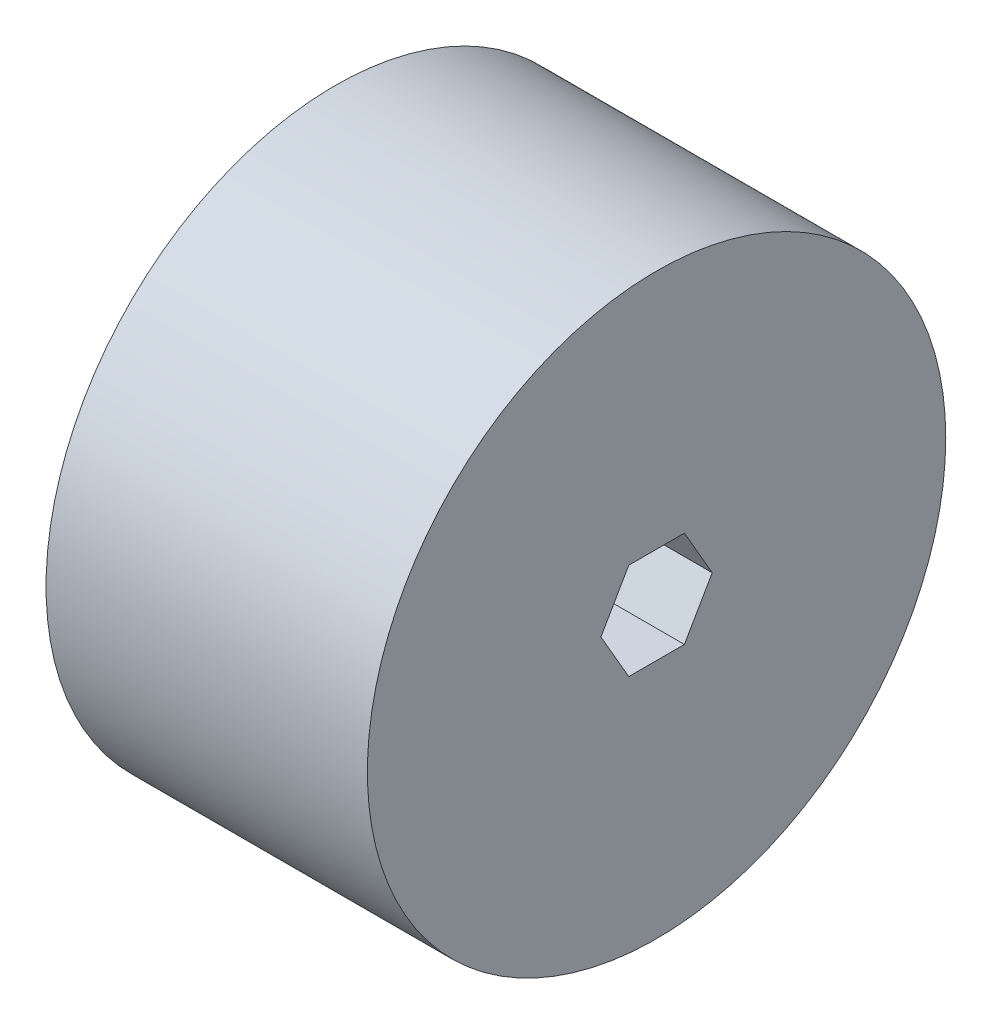
ISO-10303-21;
HEADER;
FILE_DESCRIPTION(('STEP AP214'),'2;1');
FILE_NAME('part.step','',(''),(''),'','','');
FILE_SCHEMA(('AUTOMOTIVE_DESIGN { 1 0 10303 214 1 1 1 1 }'));
ENDSEC;
DATA;
#1=APPLICATION_CONTEXT('core data for automotive mechanical design processes');
#2=APPLICATION_PROTOCOL_DEFINITION('international standard','automotive_design',2000,#1);
#3=PRODUCT_CONTEXT('',#1,'mechanical');
#4=PRODUCT('Part','Part','',(#3));
#5=PRODUCT_RELATED_PRODUCT_CATEGORY('part','',(#4));
#6=PRODUCT_DEFINITION_FORMATION('','',#4);
#7=PRODUCT_DEFINITION_CONTEXT('part definition',#1,'design');
#8=PRODUCT_DEFINITION('design','',#6,#7);
#9=PRODUCT_DEFINITION_SHAPE('','',#8);
#10=(LENGTH_UNIT() NAMED_UNIT(*) SI_UNIT(.MILLI.,.METRE.));
#11=(NAMED_UNIT(*) PLANE_ANGLE_UNIT() SI_UNIT($,.RADIAN.));
#12=(NAMED_UNIT(*) SI_UNIT($,.STERADIAN.) SOLID_ANGLE_UNIT());
#13=UNCERTAINTY_MEASURE_WITH_UNIT(LENGTH_MEASURE(1.E-05),#10,'distance_accuracy_value','');
#14=(GEOMETRIC_REPRESENTATION_CONTEXT(3) GLOBAL_UNCERTAINTY_ASSIGNED_CONTEXT((#13)) GLOBAL_UNIT_ASSIGNED_CONTEXT((#10,
#11,#12)) REPRESENTATION_CONTEXT('',''));
#15=CARTESIAN_POINT('',(0.,0.,0.));
#16=DIRECTION('',(0.,0.,1.));
#17=DIRECTION('',(1.,0.,0.));
#18=AXIS2_PLACEMENT_3D('',#15,#16,#17);
#19=CARTESIAN_POINT('',(31.75,0.,0.));
#20=DIRECTION('',(-1.,0.,0.));
#21=DIRECTION('',(0.,0.,1.));
#22=AXIS2_PLACEMENT_3D('',#19,#20,#21);
#23=CYLINDRICAL_SURFACE('',#22,28.575);
#24=CARTESIAN_POINT('',(31.75,0.,0.));
#25=DIRECTION('',(1.,0.,0.));
#26=DIRECTION('',(0.,0.,-1.));
#27=AXIS2_PLACEMENT_3D('',#24,#25,#26);
#28=CIRCLE('',#27,28.575);
#29=CARTESIAN_POINT('',(31.75,0.,-28.575));
#30=VERTEX_POINT('',#29);
#31=EDGE_CURVE('E11',#30,#30,#28,.T.);
#32=ORIENTED_EDGE('',*,*,#31,.F.);
#33=EDGE_LOOP('',(#32));
#34=FACE_BOUND('',#33,.T.);
#35=CARTESIAN_POINT('',(0.,0.,0.));
#36=DIRECTION('',(1.,0.,0.));
#37=DIRECTION('',(0.,0.,-1.));
#38=AXIS2_PLACEMENT_3D('',#35,#36,#37);
#39=CIRCLE('',#38,28.575);
#40=CARTESIAN_POINT('',(0.,0.,-28.575));
#41=VERTEX_POINT('',#40);
#42=EDGE_CURVE('E42',#41,#41,#39,.T.);
#43=ORIENTED_EDGE('',*,*,#42,.T.);
#44=EDGE_LOOP('',(#43));
#45=FACE_BOUND('',#44,.T.);
#46=ADVANCED_FACE('F39',(#34,#45),#23,.T.);
#47=CARTESIAN_POINT('',(31.75,0.,0.));
#48=DIRECTION('',(1.,0.,0.));
#49=DIRECTION('',(0.,0.,-1.));
#50=AXIS2_PLACEMENT_3D('',#47,#48,#49);
#51=PLANE('',#50);
#52=DIRECTION('',(0.,0.,1.));
#53=VECTOR('',#52,1.);
#54=CARTESIAN_POINT('',(31.75,4.7625,-2.74963065701559));
#55=LINE('',#54,#53);
#56=CARTESIAN_POINT('',(31.75,4.7625,-2.74963065701559));
#57=VERTEX_POINT('',#56);
#58=CARTESIAN_POINT('',(31.75,4.7625,2.7496306570156));
#59=VERTEX_POINT('',#58);
#60=EDGE_CURVE('E54',#57,#59,#55,.T.);
#61=ORIENTED_EDGE('',*,*,#60,.F.);
#62=DIRECTION('',(0.,0.866025403784439,0.5));
#63=VECTOR('',#62,1.);
#64=CARTESIAN_POINT('',(31.75,0.,-5.49926131403118));
#65=LINE('',#64,#63);
#66=CARTESIAN_POINT('',(31.75,0.,-5.49926131403118));
#67=VERTEX_POINT('',#66);
#68=EDGE_CURVE('E114',#67,#57,#65,.T.);
#69=ORIENTED_EDGE('',*,*,#68,.F.);
#70=DIRECTION('',(0.,0.866025403784439,-0.5));
#71=VECTOR('',#70,1.);
#72=CARTESIAN_POINT('',(31.75,-4.7625,-2.7496306570156));
#73=LINE('',#72,#71);
#74=CARTESIAN_POINT('',(31.75,-4.7625,-2.7496306570156));
#75=VERTEX_POINT('',#74);
#76=EDGE_CURVE('E118',#75,#67,#73,.T.);
#77=ORIENTED_EDGE('',*,*,#76,.F.);
#78=DIRECTION('',(0.,0.,-1.));
#79=VECTOR('',#78,1.);
#80=CARTESIAN_POINT('',(31.75,-4.7625,2.74963065701559));
#81=LINE('',#80,#79);
#82=CARTESIAN_POINT('',(31.75,-4.7625,2.74963065701559));
#83=VERTEX_POINT('',#82);
#84=EDGE_CURVE('E141',#83,#75,#81,.T.);
#85=ORIENTED_EDGE('',*,*,#84,.F.);
#86=DIRECTION('',(0.,-0.866025403784439,-0.5));
#87=VECTOR('',#86,1.);
#88=CARTESIAN_POINT('',(31.75,0.,5.49926131403118));
#89=LINE('',#88,#87);
#90=CARTESIAN_POINT('',(31.75,0.,5.49926131403118));
#91=VERTEX_POINT('',#90);
#92=EDGE_CURVE('E137',#91,#83,#89,.T.);
#93=ORIENTED_EDGE('',*,*,#92,.F.);
#94=DIRECTION('',(0.,-0.866025403784439,0.5));
#95=VECTOR('',#94,1.);
#96=CARTESIAN_POINT('',(31.75,4.7625,2.74963065701559));
#97=LINE('',#96,#95);
#98=EDGE_CURVE('E134',#59,#91,#97,.T.);
#99=ORIENTED_EDGE('',*,*,#98,.F.);
#100=EDGE_LOOP('',(#61,#69,#77,#85,#93,#99));
#101=FACE_BOUND('',#100,.T.);
#102=ORIENTED_EDGE('',*,*,#31,.T.);
#103=EDGE_LOOP('',(#102));
#104=FACE_BOUND('',#103,.T.);
#105=ADVANCED_FACE('F165',(#101,#104),#51,.T.);
#106=CARTESIAN_POINT('',(0.,0.,0.));
#107=DIRECTION('',(1.,0.,0.));
#108=DIRECTION('',(0.,0.,-1.));
#109=AXIS2_PLACEMENT_3D('',#106,#107,#108);
#110=PLANE('',#109);
#111=DIRECTION('',(0.,0.866025403784439,0.5));
#112=VECTOR('',#111,1.);
#113=CARTESIAN_POINT('',(0.,0.,-5.49926131403118));
#114=LINE('',#113,#112);
#115=CARTESIAN_POINT('',(0.,0.,-5.49926131403118));
#116=VERTEX_POINT('',#115);
#117=CARTESIAN_POINT('',(0.,4.7625,-2.74963065701559));
#118=VERTEX_POINT('',#117);
#119=EDGE_CURVE('E101',#116,#118,#114,.T.);
#120=ORIENTED_EDGE('',*,*,#119,.T.);
#121=DIRECTION('',(0.,0.,1.));
#122=VECTOR('',#121,1.);
#123=CARTESIAN_POINT('',(0.,4.7625,-2.74963065701559));
#124=LINE('',#123,#122);
#125=CARTESIAN_POINT('',(0.,4.7625,2.74963065701559));
#126=VERTEX_POINT('',#125);
#127=EDGE_CURVE('E94',#118,#126,#124,.T.);
#128=ORIENTED_EDGE('',*,*,#127,.T.);
#129=DIRECTION('',(0.,-0.866025403784439,0.5));
#130=VECTOR('',#129,1.);
#131=CARTESIAN_POINT('',(0.,4.7625,2.74963065701559));
#132=LINE('',#131,#130);
#133=CARTESIAN_POINT('',(0.,0.,5.49926131403119));
#134=VERTEX_POINT('',#133);
#135=EDGE_CURVE('E104',#126,#134,#132,.T.);
#136=ORIENTED_EDGE('',*,*,#135,.T.);
#137=DIRECTION('',(0.,-0.866025403784439,-0.5));
#138=VECTOR('',#137,1.);
#139=CARTESIAN_POINT('',(0.,0.,5.49926131403118));
#140=LINE('',#139,#138);
#141=CARTESIAN_POINT('',(0.,-4.7625,2.74963065701559));
#142=VERTEX_POINT('',#141);
#143=EDGE_CURVE('E62',#134,#142,#140,.T.);
#144=ORIENTED_EDGE('',*,*,#143,.T.);
#145=DIRECTION('',(0.,0.,-1.));
#146=VECTOR('',#145,1.);
#147=CARTESIAN_POINT('',(0.,-4.7625,2.74963065701559));
#148=LINE('',#147,#146);
#149=CARTESIAN_POINT('',(0.,-4.7625,-2.7496306570156));
#150=VERTEX_POINT('',#149);
#151=EDGE_CURVE('E123',#142,#150,#148,.T.);
#152=ORIENTED_EDGE('',*,*,#151,.T.);
#153=DIRECTION('',(0.,0.866025403784439,-0.5));
#154=VECTOR('',#153,1.);
#155=CARTESIAN_POINT('',(0.,-4.7625,-2.7496306570156));
#156=LINE('',#155,#154);
#157=EDGE_CURVE('E127',#150,#116,#156,.T.);
#158=ORIENTED_EDGE('',*,*,#157,.T.);
#159=EDGE_LOOP('',(#120,#128,#136,#144,#152,#158));
#160=FACE_BOUND('',#159,.T.);
#161=ORIENTED_EDGE('',*,*,#42,.F.);
#162=EDGE_LOOP('',(#161));
#163=FACE_BOUND('',#162,.T.);
#164=ADVANCED_FACE('F109',(#160,#163),#110,.F.);
#165=CARTESIAN_POINT('',(0.,4.7625,-2.74963065701559));
#166=DIRECTION('',(0.,1.,0.));
#167=DIRECTION('',(0.,0.,1.));
#168=AXIS2_PLACEMENT_3D('',#165,#166,#167);
#169=PLANE('',#168);
#170=ORIENTED_EDGE('',*,*,#60,.T.);
#171=DIRECTION('',(1.,0.,0.));
#172=VECTOR('',#171,1.);
#173=CARTESIAN_POINT('',(0.,4.7625,2.74963065701559));
#174=LINE('',#173,#172);
#175=EDGE_CURVE('E90',#126,#59,#174,.T.);
#176=ORIENTED_EDGE('',*,*,#175,.F.);
#177=ORIENTED_EDGE('',*,*,#127,.F.);
#178=DIRECTION('',(1.,0.,0.));
#179=VECTOR('',#178,1.);
#180=CARTESIAN_POINT('',(0.,4.7625,-2.74963065701559));
#181=LINE('',#180,#179);
#182=EDGE_CURVE('E148',#118,#57,#181,.T.);
#183=ORIENTED_EDGE('',*,*,#182,.T.);
#184=EDGE_LOOP('',(#170,#176,#177,#183));
#185=FACE_BOUND('',#184,.T.);
#186=ADVANCED_FACE('F92',(#185),#169,.F.);
#187=CARTESIAN_POINT('',(0.,0.,-5.49926131403118));
#188=DIRECTION('',(0.,0.5,-0.866025403784438));
#189=DIRECTION('',(0.,0.866025403784439,0.5));
#190=AXIS2_PLACEMENT_3D('',#187,#188,#189);
#191=PLANE('',#190);
#192=ORIENTED_EDGE('',*,*,#68,.T.);
#193=ORIENTED_EDGE('',*,*,#182,.F.);
#194=ORIENTED_EDGE('',*,*,#119,.F.);
#195=DIRECTION('',(1.,0.,0.));
#196=VECTOR('',#195,1.);
#197=CARTESIAN_POINT('',(0.,0.,-5.49926131403118));
#198=LINE('',#197,#196);
#199=EDGE_CURVE('E151',#116,#67,#198,.T.);
#200=ORIENTED_EDGE('',*,*,#199,.T.);
#201=EDGE_LOOP('',(#192,#193,#194,#200));
#202=FACE_BOUND('',#201,.T.);
#203=ADVANCED_FACE('F176',(#202),#191,.F.);
#204=CARTESIAN_POINT('',(0.,-4.7625,-2.7496306570156));
#205=DIRECTION('',(0.,-0.499999999999999,-0.866025403784439));
#206=DIRECTION('',(0.,0.866025403784439,-0.5));
#207=AXIS2_PLACEMENT_3D('',#204,#205,#206);
#208=PLANE('',#207);
#209=ORIENTED_EDGE('',*,*,#76,.T.);
#210=ORIENTED_EDGE('',*,*,#199,.F.);
#211=ORIENTED_EDGE('',*,*,#157,.F.);
#212=DIRECTION('',(1.,0.,0.));
#213=VECTOR('',#212,1.);
#214=CARTESIAN_POINT('',(0.,-4.7625,-2.7496306570156));
#215=LINE('',#214,#213);
#216=EDGE_CURVE('E154',#150,#75,#215,.T.);
#217=ORIENTED_EDGE('',*,*,#216,.T.);
#218=EDGE_LOOP('',(#209,#210,#211,#217));
#219=FACE_BOUND('',#218,.T.);
#220=ADVANCED_FACE('F174',(#219),#208,.F.);
#221=CARTESIAN_POINT('',(0.,-4.7625,2.74963065701559));
#222=DIRECTION('',(0.,-1.,0.));
#223=DIRECTION('',(0.,0.,-1.));
#224=AXIS2_PLACEMENT_3D('',#221,#222,#223);
#225=PLANE('',#224);
#226=ORIENTED_EDGE('',*,*,#84,.T.);
#227=ORIENTED_EDGE('',*,*,#216,.F.);
#228=ORIENTED_EDGE('',*,*,#151,.F.);
#229=DIRECTION('',(1.,0.,0.));
#230=VECTOR('',#229,1.);
#231=CARTESIAN_POINT('',(0.,-4.7625,2.74963065701559));
#232=LINE('',#231,#230);
#233=EDGE_CURVE('E157',#142,#83,#232,.T.);
#234=ORIENTED_EDGE('',*,*,#233,.T.);
#235=EDGE_LOOP('',(#226,#227,#228,#234));
#236=FACE_BOUND('',#235,.T.);
#237=ADVANCED_FACE('F170',(#236),#225,.F.);
#238=CARTESIAN_POINT('',(0.,0.,5.49926131403118));
#239=DIRECTION('',(0.,-0.5,0.866025403784439));
#240=DIRECTION('',(0.,-0.866025403784439,-0.5));
#241=AXIS2_PLACEMENT_3D('',#238,#239,#240);
#242=PLANE('',#241);
#243=ORIENTED_EDGE('',*,*,#92,.T.);
#244=ORIENTED_EDGE('',*,*,#233,.F.);
#245=ORIENTED_EDGE('',*,*,#143,.F.);
#246=DIRECTION('',(1.,0.,0.));
#247=VECTOR('',#246,1.);
#248=CARTESIAN_POINT('',(0.,0.,5.49926131403118));
#249=LINE('',#248,#247);
#250=EDGE_CURVE('E100',#134,#91,#249,.T.);
#251=ORIENTED_EDGE('',*,*,#250,.T.);
#252=EDGE_LOOP('',(#243,#244,#245,#251));
#253=FACE_BOUND('',#252,.T.);
#254=ADVANCED_FACE('F161',(#253),#242,.F.);
#255=CARTESIAN_POINT('',(0.,4.7625,2.74963065701559));
#256=DIRECTION('',(0.,0.5,0.866025403784439));
#257=DIRECTION('',(0.,-0.866025403784439,0.5));
#258=AXIS2_PLACEMENT_3D('',#255,#256,#257);
#259=PLANE('',#258);
#260=ORIENTED_EDGE('',*,*,#98,.T.);
#261=ORIENTED_EDGE('',*,*,#250,.F.);
#262=ORIENTED_EDGE('',*,*,#135,.F.);
#263=ORIENTED_EDGE('',*,*,#175,.T.);
#264=EDGE_LOOP('',(#260,#261,#262,#263));
#265=FACE_BOUND('',#264,.T.);
#266=ADVANCED_FACE('F105',(#265),#259,.F.);
#267=CLOSED_SHELL('',(#46,#105,#164,#186,#203,#220,#237,#254,#266));
#268=MANIFOLD_SOLID_BREP('B2',#267);
#269=ADVANCED_BREP_SHAPE_REPRESENTATION('',(#18,#268),#14);
#270=SHAPE_DEFINITION_REPRESENTATION(#9,#269);
ENDSEC;
END-ISO-10303-21;
